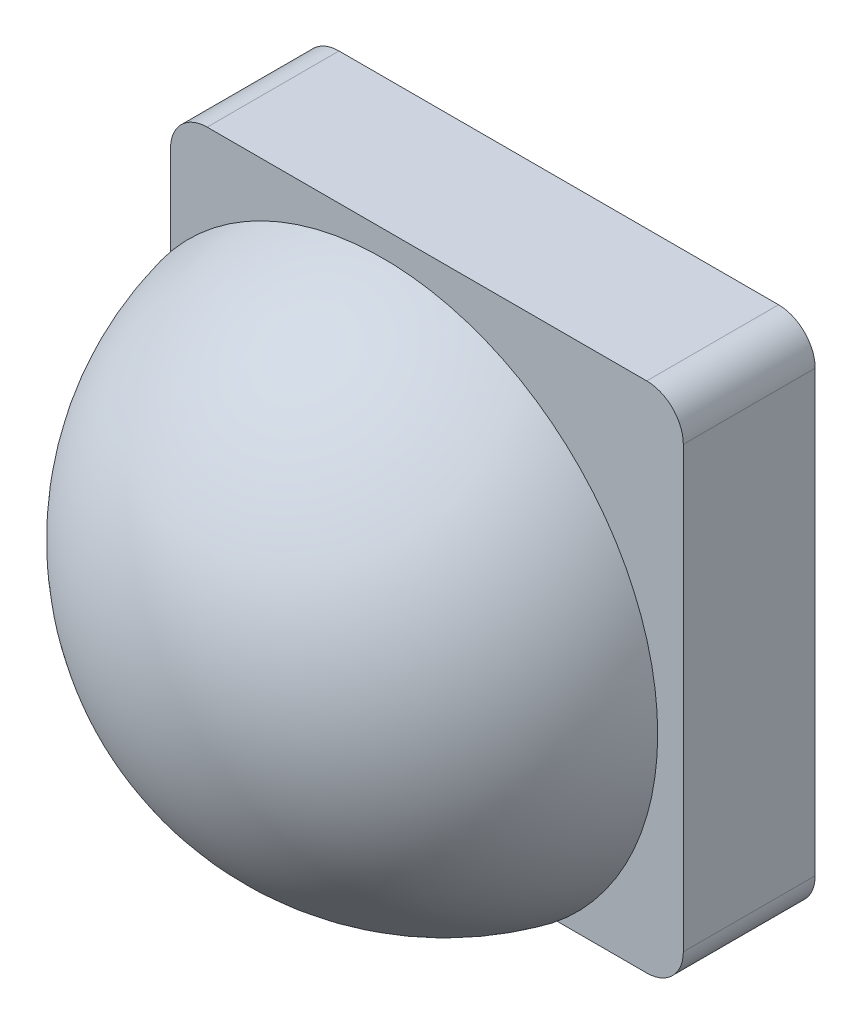
ISO-10303-21;
HEADER;
FILE_DESCRIPTION(('STEP AP214'),'2;1');
FILE_NAME('part.step','',(''),(''),'','','');
FILE_SCHEMA(('AUTOMOTIVE_DESIGN { 1 0 10303 214 1 1 1 1 }'));
ENDSEC;
DATA;
#1=APPLICATION_CONTEXT('core data for automotive mechanical design processes');
#2=APPLICATION_PROTOCOL_DEFINITION('international standard','automotive_design',2000,#1);
#3=PRODUCT_CONTEXT('',#1,'mechanical');
#4=PRODUCT('Part','Part','',(#3));
#5=PRODUCT_RELATED_PRODUCT_CATEGORY('part','',(#4));
#6=PRODUCT_DEFINITION_FORMATION('','',#4);
#7=PRODUCT_DEFINITION_CONTEXT('part definition',#1,'design');
#8=PRODUCT_DEFINITION('design','',#6,#7);
#9=PRODUCT_DEFINITION_SHAPE('','',#8);
#10=(LENGTH_UNIT() NAMED_UNIT(*) SI_UNIT(.MILLI.,.METRE.));
#11=(NAMED_UNIT(*) PLANE_ANGLE_UNIT() SI_UNIT($,.RADIAN.));
#12=(NAMED_UNIT(*) SI_UNIT($,.STERADIAN.) SOLID_ANGLE_UNIT());
#13=UNCERTAINTY_MEASURE_WITH_UNIT(LENGTH_MEASURE(1.E-05),#10,'distance_accuracy_value','');
#14=(GEOMETRIC_REPRESENTATION_CONTEXT(3) GLOBAL_UNCERTAINTY_ASSIGNED_CONTEXT((#13)) GLOBAL_UNIT_ASSIGNED_CONTEXT((#10,
#11,#12)) REPRESENTATION_CONTEXT('',''));
#15=CARTESIAN_POINT('',(0.,0.,0.));
#16=DIRECTION('',(0.,0.,1.));
#17=DIRECTION('',(1.,0.,0.));
#18=AXIS2_PLACEMENT_3D('',#15,#16,#17);
#19=CARTESIAN_POINT('',(-30.,-30.,18.));
#20=DIRECTION('',(0.,0.,-1.));
#21=DIRECTION('',(-1.,0.,0.));
#22=AXIS2_PLACEMENT_3D('',#19,#20,#21);
#23=CYLINDRICAL_SURFACE('',#22,5.);
#24=CARTESIAN_POINT('',(-30.,-30.,0.));
#25=DIRECTION('',(0.,0.,1.));
#26=DIRECTION('',(1.,0.,0.));
#27=AXIS2_PLACEMENT_3D('',#24,#25,#26);
#28=CIRCLE('',#27,5.);
#29=CARTESIAN_POINT('',(-35.,-30.,0.));
#30=VERTEX_POINT('',#29);
#31=CARTESIAN_POINT('',(-30.,-35.,0.));
#32=VERTEX_POINT('',#31);
#33=EDGE_CURVE('E147',#30,#32,#28,.T.);
#34=ORIENTED_EDGE('',*,*,#33,.T.);
#35=DIRECTION('',(0.,0.,-1.));
#36=VECTOR('',#35,1.);
#37=CARTESIAN_POINT('',(-30.,-35.,18.));
#38=LINE('',#37,#36);
#39=CARTESIAN_POINT('',(-30.,-35.,18.));
#40=VERTEX_POINT('',#39);
#41=EDGE_CURVE('E40',#40,#32,#38,.T.);
#42=ORIENTED_EDGE('',*,*,#41,.F.);
#43=CARTESIAN_POINT('',(-30.,-30.,18.));
#44=DIRECTION('',(0.,0.,1.));
#45=DIRECTION('',(1.,0.,0.));
#46=AXIS2_PLACEMENT_3D('',#43,#44,#45);
#47=CIRCLE('',#46,5.);
#48=CARTESIAN_POINT('',(-35.,-30.,18.));
#49=VERTEX_POINT('',#48);
#50=EDGE_CURVE('E163',#49,#40,#47,.T.);
#51=ORIENTED_EDGE('',*,*,#50,.F.);
#52=DIRECTION('',(0.,0.,-1.));
#53=VECTOR('',#52,1.);
#54=CARTESIAN_POINT('',(-35.,-30.,18.));
#55=LINE('',#54,#53);
#56=EDGE_CURVE('E143',#49,#30,#55,.T.);
#57=ORIENTED_EDGE('',*,*,#56,.T.);
#58=EDGE_LOOP('',(#34,#42,#51,#57));
#59=FACE_BOUND('',#58,.T.);
#60=ADVANCED_FACE('F37',(#59),#23,.T.);
#61=CARTESIAN_POINT('',(-30.,-35.,18.));
#62=DIRECTION('',(0.,1.,0.));
#63=DIRECTION('',(0.,0.,1.));
#64=AXIS2_PLACEMENT_3D('',#61,#62,#63);
#65=PLANE('',#64);
#66=DIRECTION('',(1.,0.,0.));
#67=VECTOR('',#66,1.);
#68=CARTESIAN_POINT('',(-30.,-35.,0.));
#69=LINE('',#68,#67);
#70=CARTESIAN_POINT('',(30.,-35.,0.));
#71=VERTEX_POINT('',#70);
#72=EDGE_CURVE('E150',#32,#71,#69,.T.);
#73=ORIENTED_EDGE('',*,*,#72,.T.);
#74=DIRECTION('',(0.,0.,-1.));
#75=VECTOR('',#74,1.);
#76=CARTESIAN_POINT('',(30.,-35.,18.));
#77=LINE('',#76,#75);
#78=CARTESIAN_POINT('',(30.,-35.,18.));
#79=VERTEX_POINT('',#78);
#80=EDGE_CURVE('E172',#79,#71,#77,.T.);
#81=ORIENTED_EDGE('',*,*,#80,.F.);
#82=DIRECTION('',(1.,0.,0.));
#83=VECTOR('',#82,1.);
#84=CARTESIAN_POINT('',(-30.,-35.,18.));
#85=LINE('',#84,#83);
#86=EDGE_CURVE('E103',#40,#79,#85,.T.);
#87=ORIENTED_EDGE('',*,*,#86,.F.);
#88=ORIENTED_EDGE('',*,*,#41,.T.);
#89=EDGE_LOOP('',(#73,#81,#87,#88));
#90=FACE_BOUND('',#89,.T.);
#91=ADVANCED_FACE('F178',(#90),#65,.F.);
#92=CARTESIAN_POINT('',(30.,-30.,18.));
#93=DIRECTION('',(0.,0.,-1.));
#94=DIRECTION('',(-1.,0.,0.));
#95=AXIS2_PLACEMENT_3D('',#92,#93,#94);
#96=CYLINDRICAL_SURFACE('',#95,5.);
#97=CARTESIAN_POINT('',(30.,-30.,0.));
#98=DIRECTION('',(0.,0.,1.));
#99=DIRECTION('',(1.,0.,0.));
#100=AXIS2_PLACEMENT_3D('',#97,#98,#99);
#101=CIRCLE('',#100,5.);
#102=CARTESIAN_POINT('',(35.,-30.,0.));
#103=VERTEX_POINT('',#102);
#104=EDGE_CURVE('E153',#71,#103,#101,.T.);
#105=ORIENTED_EDGE('',*,*,#104,.T.);
#106=DIRECTION('',(0.,0.,-1.));
#107=VECTOR('',#106,1.);
#108=CARTESIAN_POINT('',(35.,-30.,18.));
#109=LINE('',#108,#107);
#110=CARTESIAN_POINT('',(35.,-30.,18.));
#111=VERTEX_POINT('',#110);
#112=EDGE_CURVE('E170',#111,#103,#109,.T.);
#113=ORIENTED_EDGE('',*,*,#112,.F.);
#114=CARTESIAN_POINT('',(30.,-30.,18.));
#115=DIRECTION('',(0.,0.,1.));
#116=DIRECTION('',(1.,0.,0.));
#117=AXIS2_PLACEMENT_3D('',#114,#115,#116);
#118=CIRCLE('',#117,5.);
#119=EDGE_CURVE('E193',#79,#111,#118,.T.);
#120=ORIENTED_EDGE('',*,*,#119,.F.);
#121=ORIENTED_EDGE('',*,*,#80,.T.);
#122=EDGE_LOOP('',(#105,#113,#120,#121));
#123=FACE_BOUND('',#122,.T.);
#124=ADVANCED_FACE('F187',(#123),#96,.T.);
#125=CARTESIAN_POINT('',(35.,-30.,18.));
#126=DIRECTION('',(-1.,0.,0.));
#127=DIRECTION('',(0.,0.,1.));
#128=AXIS2_PLACEMENT_3D('',#125,#126,#127);
#129=PLANE('',#128);
#130=DIRECTION('',(0.,1.,0.));
#131=VECTOR('',#130,1.);
#132=CARTESIAN_POINT('',(35.,-30.,0.));
#133=LINE('',#132,#131);
#134=CARTESIAN_POINT('',(35.,30.,0.));
#135=VERTEX_POINT('',#134);
#136=EDGE_CURVE('E155',#103,#135,#133,.T.);
#137=ORIENTED_EDGE('',*,*,#136,.T.);
#138=DIRECTION('',(0.,0.,-1.));
#139=VECTOR('',#138,1.);
#140=CARTESIAN_POINT('',(35.,30.,18.));
#141=LINE('',#140,#139);
#142=CARTESIAN_POINT('',(35.,30.,18.));
#143=VERTEX_POINT('',#142);
#144=EDGE_CURVE('E167',#143,#135,#141,.T.);
#145=ORIENTED_EDGE('',*,*,#144,.F.);
#146=DIRECTION('',(0.,1.,0.));
#147=VECTOR('',#146,1.);
#148=CARTESIAN_POINT('',(35.,-30.,18.));
#149=LINE('',#148,#147);
#150=EDGE_CURVE('E192',#111,#143,#149,.T.);
#151=ORIENTED_EDGE('',*,*,#150,.F.);
#152=ORIENTED_EDGE('',*,*,#112,.T.);
#153=EDGE_LOOP('',(#137,#145,#151,#152));
#154=FACE_BOUND('',#153,.T.);
#155=ADVANCED_FACE('F190',(#154),#129,.F.);
#156=CARTESIAN_POINT('',(30.,30.,18.));
#157=DIRECTION('',(0.,0.,-1.));
#158=DIRECTION('',(-1.,0.,0.));
#159=AXIS2_PLACEMENT_3D('',#156,#157,#158);
#160=CYLINDRICAL_SURFACE('',#159,5.);
#161=CARTESIAN_POINT('',(30.,30.,0.));
#162=DIRECTION('',(0.,0.,1.));
#163=DIRECTION('',(1.,0.,0.));
#164=AXIS2_PLACEMENT_3D('',#161,#162,#163);
#165=CIRCLE('',#164,5.);
#166=CARTESIAN_POINT('',(30.,35.,0.));
#167=VERTEX_POINT('',#166);
#168=EDGE_CURVE('E157',#135,#167,#165,.T.);
#169=ORIENTED_EDGE('',*,*,#168,.T.);
#170=DIRECTION('',(0.,0.,-1.));
#171=VECTOR('',#170,1.);
#172=CARTESIAN_POINT('',(30.,35.,18.));
#173=LINE('',#172,#171);
#174=CARTESIAN_POINT('',(30.,35.,18.));
#175=VERTEX_POINT('',#174);
#176=EDGE_CURVE('E138',#175,#167,#173,.T.);
#177=ORIENTED_EDGE('',*,*,#176,.F.);
#178=CARTESIAN_POINT('',(30.,30.,18.));
#179=DIRECTION('',(0.,0.,1.));
#180=DIRECTION('',(1.,0.,0.));
#181=AXIS2_PLACEMENT_3D('',#178,#179,#180);
#182=CIRCLE('',#181,5.);
#183=EDGE_CURVE('E126',#143,#175,#182,.T.);
#184=ORIENTED_EDGE('',*,*,#183,.F.);
#185=ORIENTED_EDGE('',*,*,#144,.T.);
#186=EDGE_LOOP('',(#169,#177,#184,#185));
#187=FACE_BOUND('',#186,.T.);
#188=ADVANCED_FACE('F295',(#187),#160,.T.);
#189=CARTESIAN_POINT('',(30.,35.,18.));
#190=DIRECTION('',(0.,-1.,0.));
#191=DIRECTION('',(0.,0.,-1.));
#192=AXIS2_PLACEMENT_3D('',#189,#190,#191);
#193=PLANE('',#192);
#194=DIRECTION('',(-1.,0.,0.));
#195=VECTOR('',#194,1.);
#196=CARTESIAN_POINT('',(30.,35.,0.));
#197=LINE('',#196,#195);
#198=CARTESIAN_POINT('',(-30.,35.,0.));
#199=VERTEX_POINT('',#198);
#200=EDGE_CURVE('E135',#167,#199,#197,.T.);
#201=ORIENTED_EDGE('',*,*,#200,.T.);
#202=DIRECTION('',(0.,0.,-1.));
#203=VECTOR('',#202,1.);
#204=CARTESIAN_POINT('',(-30.,35.,18.));
#205=LINE('',#204,#203);
#206=CARTESIAN_POINT('',(-30.,35.,18.));
#207=VERTEX_POINT('',#206);
#208=EDGE_CURVE('E132',#207,#199,#205,.T.);
#209=ORIENTED_EDGE('',*,*,#208,.F.);
#210=DIRECTION('',(-1.,0.,0.));
#211=VECTOR('',#210,1.);
#212=CARTESIAN_POINT('',(30.,35.,18.));
#213=LINE('',#212,#211);
#214=EDGE_CURVE('E119',#175,#207,#213,.T.);
#215=ORIENTED_EDGE('',*,*,#214,.F.);
#216=ORIENTED_EDGE('',*,*,#176,.T.);
#217=EDGE_LOOP('',(#201,#209,#215,#216));
#218=FACE_BOUND('',#217,.T.);
#219=ADVANCED_FACE('F133',(#218),#193,.F.);
#220=CARTESIAN_POINT('',(-30.,30.,18.));
#221=DIRECTION('',(0.,0.,-1.));
#222=DIRECTION('',(-1.,0.,0.));
#223=AXIS2_PLACEMENT_3D('',#220,#221,#222);
#224=CYLINDRICAL_SURFACE('',#223,5.);
#225=CARTESIAN_POINT('',(-30.,30.,0.));
#226=DIRECTION('',(0.,0.,1.));
#227=DIRECTION('',(1.,0.,0.));
#228=AXIS2_PLACEMENT_3D('',#225,#226,#227);
#229=CIRCLE('',#228,5.);
#230=CARTESIAN_POINT('',(-35.,30.,0.));
#231=VERTEX_POINT('',#230);
#232=EDGE_CURVE('E160',#199,#231,#229,.T.);
#233=ORIENTED_EDGE('',*,*,#232,.T.);
#234=DIRECTION('',(0.,0.,-1.));
#235=VECTOR('',#234,1.);
#236=CARTESIAN_POINT('',(-35.,30.,18.));
#237=LINE('',#236,#235);
#238=CARTESIAN_POINT('',(-35.,30.,18.));
#239=VERTEX_POINT('',#238);
#240=EDGE_CURVE('E139',#239,#231,#237,.T.);
#241=ORIENTED_EDGE('',*,*,#240,.F.);
#242=CARTESIAN_POINT('',(-30.,30.,18.));
#243=DIRECTION('',(0.,0.,1.));
#244=DIRECTION('',(1.,0.,0.));
#245=AXIS2_PLACEMENT_3D('',#242,#243,#244);
#246=CIRCLE('',#245,5.);
#247=EDGE_CURVE('E123',#207,#239,#246,.T.);
#248=ORIENTED_EDGE('',*,*,#247,.F.);
#249=ORIENTED_EDGE('',*,*,#208,.T.);
#250=EDGE_LOOP('',(#233,#241,#248,#249));
#251=FACE_BOUND('',#250,.T.);
#252=ADVANCED_FACE('F141',(#251),#224,.T.);
#253=CARTESIAN_POINT('',(-35.,30.,18.));
#254=DIRECTION('',(1.,0.,0.));
#255=DIRECTION('',(0.,0.,-1.));
#256=AXIS2_PLACEMENT_3D('',#253,#254,#255);
#257=PLANE('',#256);
#258=DIRECTION('',(0.,-1.,0.));
#259=VECTOR('',#258,1.);
#260=CARTESIAN_POINT('',(-35.,30.,0.));
#261=LINE('',#260,#259);
#262=EDGE_CURVE('E94',#231,#30,#261,.T.);
#263=ORIENTED_EDGE('',*,*,#262,.T.);
#264=ORIENTED_EDGE('',*,*,#56,.F.);
#265=DIRECTION('',(0.,-1.,0.));
#266=VECTOR('',#265,1.);
#267=CARTESIAN_POINT('',(-35.,30.,18.));
#268=LINE('',#267,#266);
#269=EDGE_CURVE('E61',#239,#49,#268,.T.);
#270=ORIENTED_EDGE('',*,*,#269,.F.);
#271=ORIENTED_EDGE('',*,*,#240,.T.);
#272=EDGE_LOOP('',(#263,#264,#270,#271));
#273=FACE_BOUND('',#272,.T.);
#274=ADVANCED_FACE('F303',(#273),#257,.F.);
#275=CARTESIAN_POINT('',(-30.,-30.,18.));
#276=DIRECTION('',(0.,0.,1.));
#277=DIRECTION('',(1.,0.,0.));
#278=AXIS2_PLACEMENT_3D('',#275,#276,#277);
#279=PLANE('',#278);
#280=CARTESIAN_POINT('',(0.,0.,18.));
#281=DIRECTION('',(0.,0.,1.));
#282=DIRECTION('',(1.,0.,0.));
#283=AXIS2_PLACEMENT_3D('',#280,#281,#282);
#284=CIRCLE('',#283,17.5);
#285=CARTESIAN_POINT('',(17.5,0.,18.));
#286=VERTEX_POINT('',#285);
#287=EDGE_CURVE('E11',#286,#286,#284,.T.);
#288=ORIENTED_EDGE('',*,*,#287,.F.);
#289=EDGE_LOOP('',(#288));
#290=FACE_BOUND('',#289,.T.);
#291=ORIENTED_EDGE('',*,*,#50,.T.);
#292=ORIENTED_EDGE('',*,*,#86,.T.);
#293=ORIENTED_EDGE('',*,*,#119,.T.);
#294=ORIENTED_EDGE('',*,*,#150,.T.);
#295=ORIENTED_EDGE('',*,*,#183,.T.);
#296=ORIENTED_EDGE('',*,*,#214,.T.);
#297=ORIENTED_EDGE('',*,*,#247,.T.);
#298=ORIENTED_EDGE('',*,*,#269,.T.);
#299=EDGE_LOOP('',(#291,#292,#293,#294,#295,#296,#297,#298));
#300=FACE_BOUND('',#299,.T.);
#301=ADVANCED_FACE('F121',(#290,#300),#279,.T.);
#302=CARTESIAN_POINT('',(-30.,-30.,0.));
#303=DIRECTION('',(0.,0.,1.));
#304=DIRECTION('',(1.,0.,0.));
#305=AXIS2_PLACEMENT_3D('',#302,#303,#304);
#306=PLANE('',#305);
#307=DIRECTION('',(0.,-1.,0.));
#308=VECTOR('',#307,1.);
#309=CARTESIAN_POINT('',(-33.,30.,0.));
#310=LINE('',#309,#308);
#311=CARTESIAN_POINT('',(-33.,30.,0.));
#312=VERTEX_POINT('',#311);
#313=CARTESIAN_POINT('',(-33.,-30.,0.));
#314=VERTEX_POINT('',#313);
#315=EDGE_CURVE('E216',#312,#314,#310,.T.);
#316=ORIENTED_EDGE('',*,*,#315,.T.);
#317=CARTESIAN_POINT('',(-30.,-30.,0.));
#318=DIRECTION('',(0.,0.,1.));
#319=DIRECTION('',(1.,0.,0.));
#320=AXIS2_PLACEMENT_3D('',#317,#318,#319);
#321=CIRCLE('',#320,3.);
#322=CARTESIAN_POINT('',(-30.,-33.,0.));
#323=VERTEX_POINT('',#322);
#324=EDGE_CURVE('E202',#314,#323,#321,.T.);
#325=ORIENTED_EDGE('',*,*,#324,.T.);
#326=DIRECTION('',(1.,0.,0.));
#327=VECTOR('',#326,1.);
#328=CARTESIAN_POINT('',(-30.,-33.,0.));
#329=LINE('',#328,#327);
#330=CARTESIAN_POINT('',(30.,-33.,0.));
#331=VERTEX_POINT('',#330);
#332=EDGE_CURVE('E199',#323,#331,#329,.T.);
#333=ORIENTED_EDGE('',*,*,#332,.T.);
#334=CARTESIAN_POINT('',(30.,-30.,0.));
#335=DIRECTION('',(0.,0.,1.));
#336=DIRECTION('',(1.,0.,0.));
#337=AXIS2_PLACEMENT_3D('',#334,#335,#336);
#338=CIRCLE('',#337,3.);
#339=CARTESIAN_POINT('',(33.,-30.,0.));
#340=VERTEX_POINT('',#339);
#341=EDGE_CURVE('E52',#331,#340,#338,.T.);
#342=ORIENTED_EDGE('',*,*,#341,.T.);
#343=DIRECTION('',(0.,1.,0.));
#344=VECTOR('',#343,1.);
#345=CARTESIAN_POINT('',(33.,-30.,0.));
#346=LINE('',#345,#344);
#347=CARTESIAN_POINT('',(33.,30.,0.));
#348=VERTEX_POINT('',#347);
#349=EDGE_CURVE('E204',#340,#348,#346,.T.);
#350=ORIENTED_EDGE('',*,*,#349,.T.);
#351=CARTESIAN_POINT('',(30.,30.,0.));
#352=DIRECTION('',(0.,0.,1.));
#353=DIRECTION('',(1.,0.,0.));
#354=AXIS2_PLACEMENT_3D('',#351,#352,#353);
#355=CIRCLE('',#354,3.);
#356=CARTESIAN_POINT('',(30.,33.,0.));
#357=VERTEX_POINT('',#356);
#358=EDGE_CURVE('E207',#348,#357,#355,.T.);
#359=ORIENTED_EDGE('',*,*,#358,.T.);
#360=DIRECTION('',(-1.,0.,0.));
#361=VECTOR('',#360,1.);
#362=CARTESIAN_POINT('',(30.,33.,0.));
#363=LINE('',#362,#361);
#364=CARTESIAN_POINT('',(-30.,33.,0.));
#365=VERTEX_POINT('',#364);
#366=EDGE_CURVE('E210',#357,#365,#363,.T.);
#367=ORIENTED_EDGE('',*,*,#366,.T.);
#368=CARTESIAN_POINT('',(-30.,30.,0.));
#369=DIRECTION('',(0.,0.,1.));
#370=DIRECTION('',(1.,0.,0.));
#371=AXIS2_PLACEMENT_3D('',#368,#369,#370);
#372=CIRCLE('',#371,3.);
#373=EDGE_CURVE('E213',#365,#312,#372,.T.);
#374=ORIENTED_EDGE('',*,*,#373,.T.);
#375=EDGE_LOOP('',(#316,#325,#333,#342,#350,#359,#367,#374));
#376=FACE_BOUND('',#375,.T.);
#377=ORIENTED_EDGE('',*,*,#33,.F.);
#378=ORIENTED_EDGE('',*,*,#262,.F.);
#379=ORIENTED_EDGE('',*,*,#232,.F.);
#380=ORIENTED_EDGE('',*,*,#200,.F.);
#381=ORIENTED_EDGE('',*,*,#168,.F.);
#382=ORIENTED_EDGE('',*,*,#136,.F.);
#383=ORIENTED_EDGE('',*,*,#104,.F.);
#384=ORIENTED_EDGE('',*,*,#72,.F.);
#385=EDGE_LOOP('',(#377,#378,#379,#380,#381,#382,#383,#384));
#386=FACE_BOUND('',#385,.T.);
#387=ADVANCED_FACE('F183',(#376,#386),#306,.F.);
#388=CARTESIAN_POINT('',(-30.,-30.,18.));
#389=DIRECTION('',(0.,0.,-1.));
#390=DIRECTION('',(-1.,0.,0.));
#391=AXIS2_PLACEMENT_3D('',#388,#389,#390);
#392=CYLINDRICAL_SURFACE('',#391,3.);
#393=ORIENTED_EDGE('',*,*,#324,.F.);
#394=DIRECTION('',(0.,0.,-1.));
#395=VECTOR('',#394,1.);
#396=CARTESIAN_POINT('',(-33.,-30.,18.));
#397=LINE('',#396,#395);
#398=CARTESIAN_POINT('',(-33.,-30.,16.));
#399=VERTEX_POINT('',#398);
#400=EDGE_CURVE('E226',#399,#314,#397,.T.);
#401=ORIENTED_EDGE('',*,*,#400,.F.);
#402=CARTESIAN_POINT('',(-30.,-30.,16.));
#403=DIRECTION('',(0.,0.,1.));
#404=DIRECTION('',(1.,0.,0.));
#405=AXIS2_PLACEMENT_3D('',#402,#403,#404);
#406=CIRCLE('',#405,3.);
#407=CARTESIAN_POINT('',(-30.,-33.,16.));
#408=VERTEX_POINT('',#407);
#409=EDGE_CURVE('E219',#399,#408,#406,.T.);
#410=ORIENTED_EDGE('',*,*,#409,.T.);
#411=DIRECTION('',(0.,0.,1.));
#412=VECTOR('',#411,1.);
#413=CARTESIAN_POINT('',(-30.,-33.,18.));
#414=LINE('',#413,#412);
#415=EDGE_CURVE('E151',#408,#323,#414,.F.);
#416=ORIENTED_EDGE('',*,*,#415,.T.);
#417=EDGE_LOOP('',(#393,#401,#410,#416));
#418=FACE_BOUND('',#417,.T.);
#419=ADVANCED_FACE('F308',(#418),#392,.F.);
#420=CARTESIAN_POINT('',(-30.,-33.,18.));
#421=DIRECTION('',(0.,1.,0.));
#422=DIRECTION('',(0.,0.,1.));
#423=AXIS2_PLACEMENT_3D('',#420,#421,#422);
#424=PLANE('',#423);
#425=ORIENTED_EDGE('',*,*,#332,.F.);
#426=ORIENTED_EDGE('',*,*,#415,.F.);
#427=DIRECTION('',(1.,0.,0.));
#428=VECTOR('',#427,1.);
#429=CARTESIAN_POINT('',(-30.,-33.,16.));
#430=LINE('',#429,#428);
#431=CARTESIAN_POINT('',(30.,-33.,16.));
#432=VERTEX_POINT('',#431);
#433=EDGE_CURVE('E255',#408,#432,#430,.T.);
#434=ORIENTED_EDGE('',*,*,#433,.T.);
#435=DIRECTION('',(0.,0.,-1.));
#436=VECTOR('',#435,1.);
#437=CARTESIAN_POINT('',(30.,-33.,18.));
#438=LINE('',#437,#436);
#439=EDGE_CURVE('E257',#432,#331,#438,.T.);
#440=ORIENTED_EDGE('',*,*,#439,.T.);
#441=EDGE_LOOP('',(#425,#426,#434,#440));
#442=FACE_BOUND('',#441,.T.);
#443=ADVANCED_FACE('F340',(#442),#424,.T.);
#444=CARTESIAN_POINT('',(30.,-30.,18.));
#445=DIRECTION('',(0.,0.,-1.));
#446=DIRECTION('',(-1.,0.,0.));
#447=AXIS2_PLACEMENT_3D('',#444,#445,#446);
#448=CYLINDRICAL_SURFACE('',#447,3.);
#449=ORIENTED_EDGE('',*,*,#341,.F.);
#450=ORIENTED_EDGE('',*,*,#439,.F.);
#451=CARTESIAN_POINT('',(30.,-30.,16.));
#452=DIRECTION('',(0.,0.,1.));
#453=DIRECTION('',(1.,0.,0.));
#454=AXIS2_PLACEMENT_3D('',#451,#452,#453);
#455=CIRCLE('',#454,3.);
#456=CARTESIAN_POINT('',(33.,-30.,16.));
#457=VERTEX_POINT('',#456);
#458=EDGE_CURVE('E249',#432,#457,#455,.T.);
#459=ORIENTED_EDGE('',*,*,#458,.T.);
#460=DIRECTION('',(0.,0.,1.));
#461=VECTOR('',#460,1.);
#462=CARTESIAN_POINT('',(33.,-30.,18.));
#463=LINE('',#462,#461);
#464=EDGE_CURVE('E252',#457,#340,#463,.F.);
#465=ORIENTED_EDGE('',*,*,#464,.T.);
#466=EDGE_LOOP('',(#449,#450,#459,#465));
#467=FACE_BOUND('',#466,.T.);
#468=ADVANCED_FACE('F336',(#467),#448,.F.);
#469=CARTESIAN_POINT('',(33.,-30.,18.));
#470=DIRECTION('',(-1.,0.,0.));
#471=DIRECTION('',(0.,0.,1.));
#472=AXIS2_PLACEMENT_3D('',#469,#470,#471);
#473=PLANE('',#472);
#474=ORIENTED_EDGE('',*,*,#349,.F.);
#475=ORIENTED_EDGE('',*,*,#464,.F.);
#476=DIRECTION('',(0.,1.,0.));
#477=VECTOR('',#476,1.);
#478=CARTESIAN_POINT('',(33.,-30.,16.));
#479=LINE('',#478,#477);
#480=CARTESIAN_POINT('',(33.,30.,16.));
#481=VERTEX_POINT('',#480);
#482=EDGE_CURVE('E243',#457,#481,#479,.T.);
#483=ORIENTED_EDGE('',*,*,#482,.T.);
#484=DIRECTION('',(0.,0.,-1.));
#485=VECTOR('',#484,1.);
#486=CARTESIAN_POINT('',(33.,30.,18.));
#487=LINE('',#486,#485);
#488=EDGE_CURVE('E246',#481,#348,#487,.T.);
#489=ORIENTED_EDGE('',*,*,#488,.T.);
#490=EDGE_LOOP('',(#474,#475,#483,#489));
#491=FACE_BOUND('',#490,.T.);
#492=ADVANCED_FACE('F332',(#491),#473,.T.);
#493=CARTESIAN_POINT('',(30.,30.,18.));
#494=DIRECTION('',(0.,0.,-1.));
#495=DIRECTION('',(-1.,0.,0.));
#496=AXIS2_PLACEMENT_3D('',#493,#494,#495);
#497=CYLINDRICAL_SURFACE('',#496,3.);
#498=ORIENTED_EDGE('',*,*,#358,.F.);
#499=ORIENTED_EDGE('',*,*,#488,.F.);
#500=CARTESIAN_POINT('',(30.,30.,16.));
#501=DIRECTION('',(0.,0.,1.));
#502=DIRECTION('',(1.,0.,0.));
#503=AXIS2_PLACEMENT_3D('',#500,#501,#502);
#504=CIRCLE('',#503,3.);
#505=CARTESIAN_POINT('',(30.,33.,16.));
#506=VERTEX_POINT('',#505);
#507=EDGE_CURVE('E237',#481,#506,#504,.T.);
#508=ORIENTED_EDGE('',*,*,#507,.T.);
#509=DIRECTION('',(0.,0.,-1.));
#510=VECTOR('',#509,1.);
#511=CARTESIAN_POINT('',(30.,33.,18.));
#512=LINE('',#511,#510);
#513=EDGE_CURVE('E240',#506,#357,#512,.T.);
#514=ORIENTED_EDGE('',*,*,#513,.T.);
#515=EDGE_LOOP('',(#498,#499,#508,#514));
#516=FACE_BOUND('',#515,.T.);
#517=ADVANCED_FACE('F328',(#516),#497,.F.);
#518=CARTESIAN_POINT('',(30.,33.,18.));
#519=DIRECTION('',(0.,-1.,0.));
#520=DIRECTION('',(0.,0.,-1.));
#521=AXIS2_PLACEMENT_3D('',#518,#519,#520);
#522=PLANE('',#521);
#523=ORIENTED_EDGE('',*,*,#366,.F.);
#524=ORIENTED_EDGE('',*,*,#513,.F.);
#525=DIRECTION('',(-1.,0.,0.));
#526=VECTOR('',#525,1.);
#527=CARTESIAN_POINT('',(30.,33.,16.));
#528=LINE('',#527,#526);
#529=CARTESIAN_POINT('',(-30.,33.,16.));
#530=VERTEX_POINT('',#529);
#531=EDGE_CURVE('E230',#506,#530,#528,.T.);
#532=ORIENTED_EDGE('',*,*,#531,.T.);
#533=DIRECTION('',(0.,0.,-1.));
#534=VECTOR('',#533,1.);
#535=CARTESIAN_POINT('',(-30.,33.,18.));
#536=LINE('',#535,#534);
#537=EDGE_CURVE('E234',#530,#365,#536,.T.);
#538=ORIENTED_EDGE('',*,*,#537,.T.);
#539=EDGE_LOOP('',(#523,#524,#532,#538));
#540=FACE_BOUND('',#539,.T.);
#541=ADVANCED_FACE('F324',(#540),#522,.T.);
#542=CARTESIAN_POINT('',(-30.,30.,18.));
#543=DIRECTION('',(0.,0.,-1.));
#544=DIRECTION('',(-1.,0.,0.));
#545=AXIS2_PLACEMENT_3D('',#542,#543,#544);
#546=CYLINDRICAL_SURFACE('',#545,3.);
#547=ORIENTED_EDGE('',*,*,#373,.F.);
#548=ORIENTED_EDGE('',*,*,#537,.F.);
#549=CARTESIAN_POINT('',(-30.,30.,16.));
#550=DIRECTION('',(0.,0.,1.));
#551=DIRECTION('',(1.,0.,0.));
#552=AXIS2_PLACEMENT_3D('',#549,#550,#551);
#553=CIRCLE('',#552,3.);
#554=CARTESIAN_POINT('',(-33.,30.,16.));
#555=VERTEX_POINT('',#554);
#556=EDGE_CURVE('E227',#530,#555,#553,.T.);
#557=ORIENTED_EDGE('',*,*,#556,.T.);
#558=DIRECTION('',(0.,0.,-1.));
#559=VECTOR('',#558,1.);
#560=CARTESIAN_POINT('',(-33.,30.,18.));
#561=LINE('',#560,#559);
#562=EDGE_CURVE('E231',#555,#312,#561,.T.);
#563=ORIENTED_EDGE('',*,*,#562,.T.);
#564=EDGE_LOOP('',(#547,#548,#557,#563));
#565=FACE_BOUND('',#564,.T.);
#566=ADVANCED_FACE('F320',(#565),#546,.F.);
#567=CARTESIAN_POINT('',(-33.,30.,18.));
#568=DIRECTION('',(1.,0.,0.));
#569=DIRECTION('',(0.,0.,-1.));
#570=AXIS2_PLACEMENT_3D('',#567,#568,#569);
#571=PLANE('',#570);
#572=ORIENTED_EDGE('',*,*,#315,.F.);
#573=ORIENTED_EDGE('',*,*,#562,.F.);
#574=DIRECTION('',(0.,-1.,0.));
#575=VECTOR('',#574,1.);
#576=CARTESIAN_POINT('',(-33.,30.,16.));
#577=LINE('',#576,#575);
#578=EDGE_CURVE('E223',#555,#399,#577,.T.);
#579=ORIENTED_EDGE('',*,*,#578,.T.);
#580=ORIENTED_EDGE('',*,*,#400,.T.);
#581=EDGE_LOOP('',(#572,#573,#579,#580));
#582=FACE_BOUND('',#581,.T.);
#583=ADVANCED_FACE('F316',(#582),#571,.T.);
#584=CARTESIAN_POINT('',(-30.,-30.,16.));
#585=DIRECTION('',(0.,0.,1.));
#586=DIRECTION('',(1.,0.,0.));
#587=AXIS2_PLACEMENT_3D('',#584,#585,#586);
#588=PLANE('',#587);
#589=ORIENTED_EDGE('',*,*,#409,.F.);
#590=ORIENTED_EDGE('',*,*,#578,.F.);
#591=ORIENTED_EDGE('',*,*,#556,.F.);
#592=ORIENTED_EDGE('',*,*,#531,.F.);
#593=ORIENTED_EDGE('',*,*,#507,.F.);
#594=ORIENTED_EDGE('',*,*,#482,.F.);
#595=ORIENTED_EDGE('',*,*,#458,.F.);
#596=ORIENTED_EDGE('',*,*,#433,.F.);
#597=EDGE_LOOP('',(#589,#590,#591,#592,#593,#594,#595,#596));
#598=FACE_BOUND('',#597,.T.);
#599=ADVANCED_FACE('F313',(#598),#588,.F.);
#600=CARTESIAN_POINT('',(0.,0.,24.));
#601=DIRECTION('',(0.,0.,-1.));
#602=DIRECTION('',(-1.,0.,0.));
#603=AXIS2_PLACEMENT_3D('',#600,#601,#602);
#604=CYLINDRICAL_SURFACE('',#603,17.5);
#605=CARTESIAN_POINT('',(0.,0.,24.));
#606=DIRECTION('',(0.,0.,1.));
#607=DIRECTION('',(1.,0.,0.));
#608=AXIS2_PLACEMENT_3D('',#605,#606,#607);
#609=CIRCLE('',#608,17.5);
#610=CARTESIAN_POINT('',(17.5,0.,24.));
#611=VERTEX_POINT('',#610);
#612=EDGE_CURVE('E222',#611,#611,#609,.T.);
#613=ORIENTED_EDGE('',*,*,#612,.F.);
#614=EDGE_LOOP('',(#613));
#615=FACE_BOUND('',#614,.T.);
#616=ORIENTED_EDGE('',*,*,#287,.T.);
#617=EDGE_LOOP('',(#616));
#618=FACE_BOUND('',#617,.T.);
#619=ADVANCED_FACE('F281',(#615,#618),#604,.T.);
#620=CARTESIAN_POINT('',(0.,0.,24.));
#621=DIRECTION('',(0.,0.,1.));
#622=DIRECTION('',(1.,0.,0.));
#623=AXIS2_PLACEMENT_3D('',#620,#621,#622);
#624=PLANE('',#623);
#625=ORIENTED_EDGE('',*,*,#612,.T.);
#626=EDGE_LOOP('',(#625));
#627=FACE_BOUND('',#626,.T.);
#628=CARTESIAN_POINT('',(0.,0.,24.));
#629=DIRECTION('',(0.,0.,-1.));
#630=DIRECTION('',(-1.,0.,0.));
#631=AXIS2_PLACEMENT_3D('',#628,#629,#630);
#632=CIRCLE('',#631,37.5);
#633=CARTESIAN_POINT('',(-37.5,0.,24.));
#634=VERTEX_POINT('',#633);
#635=EDGE_CURVE('E269',#634,#634,#632,.T.);
#636=ORIENTED_EDGE('',*,*,#635,.T.);
#637=EDGE_LOOP('',(#636));
#638=FACE_BOUND('',#637,.T.);
#639=ADVANCED_FACE('F273',(#627,#638),#624,.F.);
#640=CARTESIAN_POINT('',(0.,0.,15.5625));
#641=DIRECTION('',(0.,0.,-1.));
#642=DIRECTION('',(1.,0.,0.));
#643=AXIS2_PLACEMENT_3D('',#640,#641,#642);
#644=SPHERICAL_SURFACE('',#643,38.4375);
#645=ORIENTED_EDGE('',*,*,#635,.F.);
#646=EDGE_LOOP('',(#645));
#647=FACE_BOUND('',#646,.T.);
#648=ADVANCED_FACE('F275',(#647),#644,.T.);
#649=CLOSED_SHELL('',(#60,#91,#124,#155,#188,#219,#252,#274,#301,#387,#419,#443,#468,#492,#517,
#541,#566,#583,#599,#619,#639,#648));
#650=MANIFOLD_SOLID_BREP('B2',#649);
#651=ADVANCED_BREP_SHAPE_REPRESENTATION('',(#18,#650),#14);
#652=SHAPE_DEFINITION_REPRESENTATION(#9,#651);
ENDSEC;
END-ISO-10303-21;
